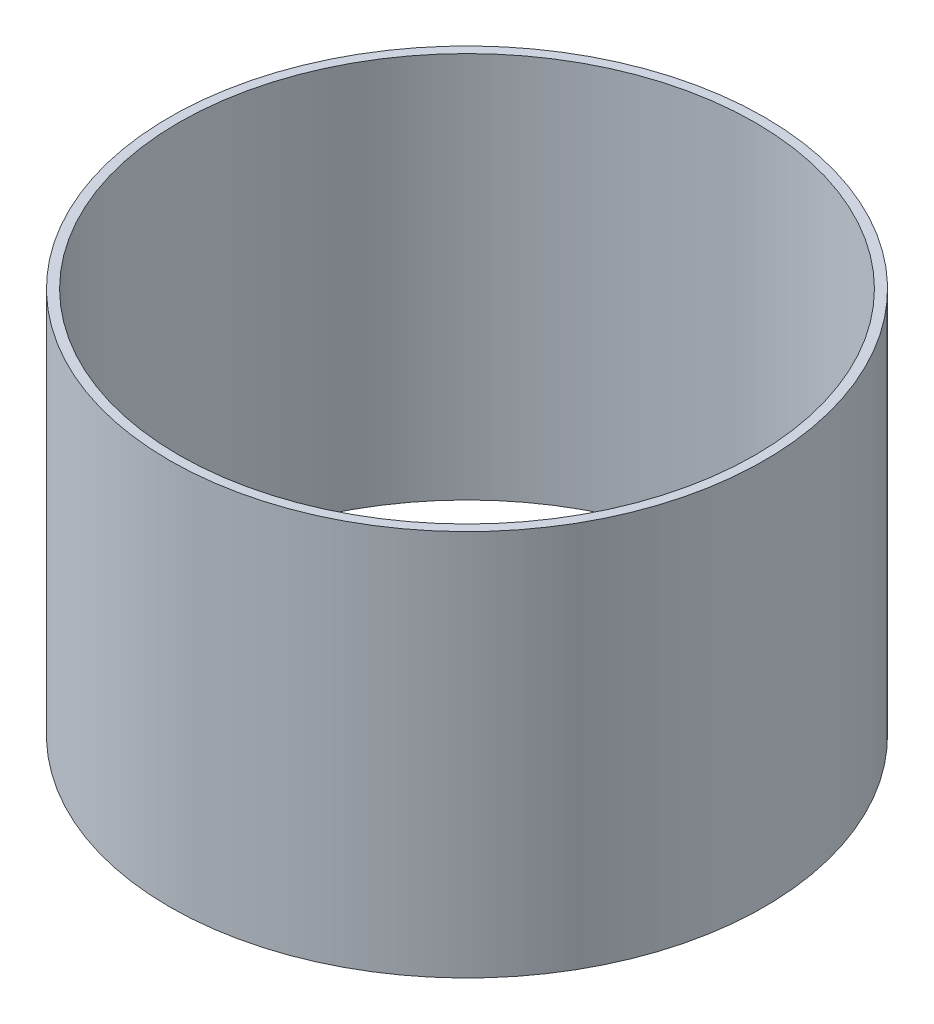
ISO-10303-21;
HEADER;
FILE_DESCRIPTION(('STEP AP214'),'2;1');
FILE_NAME('part.step','',(''),(''),'','','');
FILE_SCHEMA(('AUTOMOTIVE_DESIGN { 1 0 10303 214 1 1 1 1 }'));
ENDSEC;
DATA;
#1=APPLICATION_CONTEXT('core data for automotive mechanical design processes');
#2=APPLICATION_PROTOCOL_DEFINITION('international standard','automotive_design',2000,#1);
#3=PRODUCT_CONTEXT('',#1,'mechanical');
#4=PRODUCT('Part','Part','',(#3));
#5=PRODUCT_RELATED_PRODUCT_CATEGORY('part','',(#4));
#6=PRODUCT_DEFINITION_FORMATION('','',#4);
#7=PRODUCT_DEFINITION_CONTEXT('part definition',#1,'design');
#8=PRODUCT_DEFINITION('design','',#6,#7);
#9=PRODUCT_DEFINITION_SHAPE('','',#8);
#10=(LENGTH_UNIT() NAMED_UNIT(*) SI_UNIT(.MILLI.,.METRE.));
#11=(NAMED_UNIT(*) PLANE_ANGLE_UNIT() SI_UNIT($,.RADIAN.));
#12=(NAMED_UNIT(*) SI_UNIT($,.STERADIAN.) SOLID_ANGLE_UNIT());
#13=UNCERTAINTY_MEASURE_WITH_UNIT(LENGTH_MEASURE(1.E-05),#10,'distance_accuracy_value','');
#14=(GEOMETRIC_REPRESENTATION_CONTEXT(3) GLOBAL_UNCERTAINTY_ASSIGNED_CONTEXT((#13)) GLOBAL_UNIT_ASSIGNED_CONTEXT((#10,
#11,#12)) REPRESENTATION_CONTEXT('',''));
#15=CARTESIAN_POINT('',(0.,0.,0.));
#16=DIRECTION('',(0.,0.,1.));
#17=DIRECTION('',(1.,0.,0.));
#18=AXIS2_PLACEMENT_3D('',#15,#16,#17);
#19=CARTESIAN_POINT('',(0.,198.12,0.));
#20=DIRECTION('',(0.,1.,0.));
#21=DIRECTION('',(0.,0.,1.));
#22=AXIS2_PLACEMENT_3D('',#19,#20,#21);
#23=PLANE('',#22);
#24=CARTESIAN_POINT('',(0.,198.12,0.));
#25=DIRECTION('',(0.,1.,0.));
#26=DIRECTION('',(0.,0.,1.));
#27=AXIS2_PLACEMENT_3D('',#24,#25,#26);
#28=CIRCLE('',#27,152.4);
#29=CARTESIAN_POINT('',(0.,198.12,152.4));
#30=VERTEX_POINT('',#29);
#31=EDGE_CURVE('E10',#30,#30,#28,.T.);
#32=ORIENTED_EDGE('',*,*,#31,.T.);
#33=EDGE_LOOP('',(#32));
#34=FACE_BOUND('',#33,.T.);
#35=CARTESIAN_POINT('',(0.,198.12,0.));
#36=DIRECTION('',(0.,1.,0.));
#37=DIRECTION('',(0.,0.,1.));
#38=AXIS2_PLACEMENT_3D('',#35,#36,#37);
#39=CIRCLE('',#38,147.6375);
#40=CARTESIAN_POINT('',(0.,198.12,147.6375));
#41=VERTEX_POINT('',#40);
#42=EDGE_CURVE('E42',#41,#41,#39,.T.);
#43=ORIENTED_EDGE('',*,*,#42,.F.);
#44=EDGE_LOOP('',(#43));
#45=FACE_BOUND('',#44,.T.);
#46=ADVANCED_FACE('F31',(#34,#45),#23,.T.);
#47=CARTESIAN_POINT('',(0.,0.,0.));
#48=DIRECTION('',(0.,1.,0.));
#49=DIRECTION('',(0.,0.,1.));
#50=AXIS2_PLACEMENT_3D('',#47,#48,#49);
#51=PLANE('',#50);
#52=CARTESIAN_POINT('',(0.,0.,0.));
#53=DIRECTION('',(0.,1.,0.));
#54=DIRECTION('',(0.,0.,1.));
#55=AXIS2_PLACEMENT_3D('',#52,#53,#54);
#56=CIRCLE('',#55,152.4);
#57=CARTESIAN_POINT('',(0.,0.,152.4));
#58=VERTEX_POINT('',#57);
#59=EDGE_CURVE('E35',#58,#58,#56,.T.);
#60=ORIENTED_EDGE('',*,*,#59,.F.);
#61=EDGE_LOOP('',(#60));
#62=FACE_BOUND('',#61,.T.);
#63=CARTESIAN_POINT('',(0.,0.,0.));
#64=DIRECTION('',(0.,1.,0.));
#65=DIRECTION('',(0.,0.,1.));
#66=AXIS2_PLACEMENT_3D('',#63,#64,#65);
#67=CIRCLE('',#66,147.6375);
#68=CARTESIAN_POINT('',(0.,0.,147.6375));
#69=VERTEX_POINT('',#68);
#70=EDGE_CURVE('E44',#69,#69,#67,.T.);
#71=ORIENTED_EDGE('',*,*,#70,.T.);
#72=EDGE_LOOP('',(#71));
#73=FACE_BOUND('',#72,.T.);
#74=ADVANCED_FACE('F54',(#62,#73),#51,.F.);
#75=CARTESIAN_POINT('',(0.,198.12,0.));
#76=DIRECTION('',(0.,-1.,0.));
#77=DIRECTION('',(0.,0.,-1.));
#78=AXIS2_PLACEMENT_3D('',#75,#76,#77);
#79=CYLINDRICAL_SURFACE('',#78,152.4);
#80=ORIENTED_EDGE('',*,*,#31,.F.);
#81=EDGE_LOOP('',(#80));
#82=FACE_BOUND('',#81,.T.);
#83=ORIENTED_EDGE('',*,*,#59,.T.);
#84=EDGE_LOOP('',(#83));
#85=FACE_BOUND('',#84,.T.);
#86=ADVANCED_FACE('F33',(#82,#85),#79,.T.);
#87=CARTESIAN_POINT('',(0.,198.12,0.));
#88=DIRECTION('',(0.,-1.,0.));
#89=DIRECTION('',(0.,0.,-1.));
#90=AXIS2_PLACEMENT_3D('',#87,#88,#89);
#91=CYLINDRICAL_SURFACE('',#90,147.6375);
#92=ORIENTED_EDGE('',*,*,#42,.T.);
#93=EDGE_LOOP('',(#92));
#94=FACE_BOUND('',#93,.T.);
#95=ORIENTED_EDGE('',*,*,#70,.F.);
#96=EDGE_LOOP('',(#95));
#97=FACE_BOUND('',#96,.T.);
#98=ADVANCED_FACE('F50',(#94,#97),#91,.F.);
#99=CLOSED_SHELL('',(#46,#74,#86,#98));
#100=MANIFOLD_SOLID_BREP('B2',#99);
#101=ADVANCED_BREP_SHAPE_REPRESENTATION('',(#18,#100),#14);
#102=SHAPE_DEFINITION_REPRESENTATION(#9,#101);
ENDSEC;
END-ISO-10303-21;
